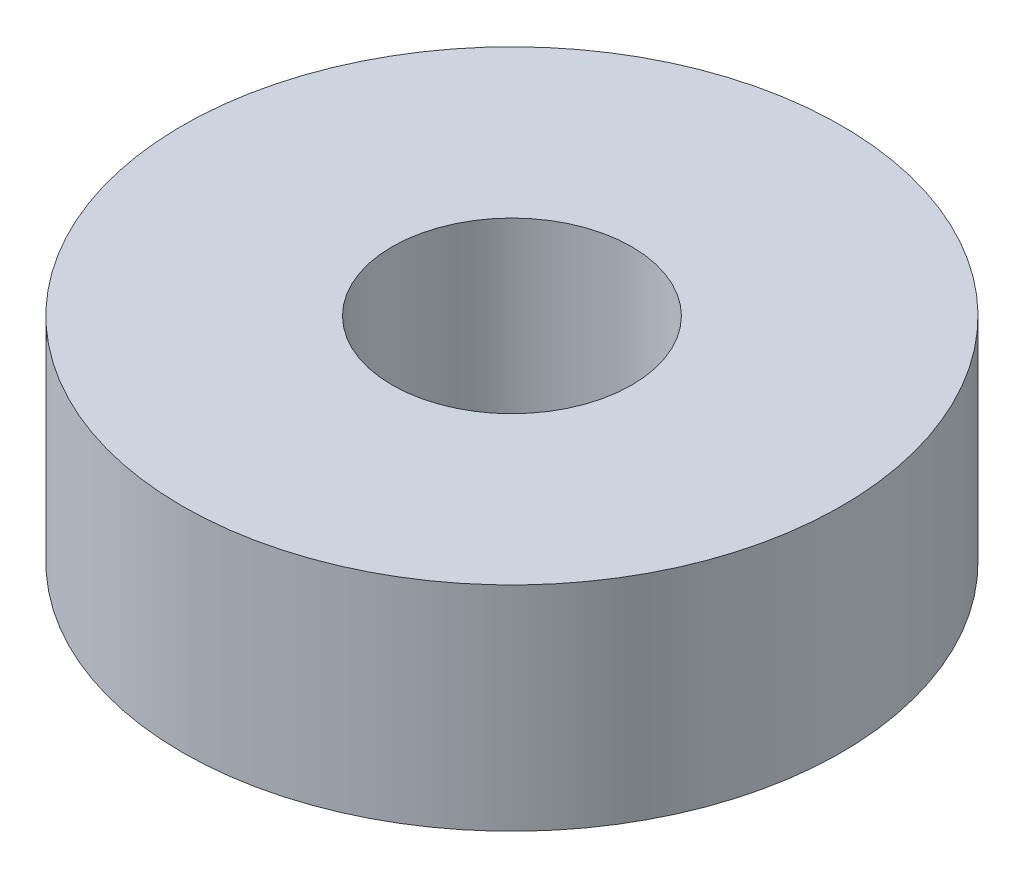
ISO-10303-21;
HEADER;
FILE_DESCRIPTION(('STEP AP214'),'2;1');
FILE_NAME('part.step','',(''),(''),'','','');
FILE_SCHEMA(('AUTOMOTIVE_DESIGN { 1 0 10303 214 1 1 1 1 }'));
ENDSEC;
DATA;
#1=APPLICATION_CONTEXT('core data for automotive mechanical design processes');
#2=APPLICATION_PROTOCOL_DEFINITION('international standard','automotive_design',2000,#1);
#3=PRODUCT_CONTEXT('',#1,'mechanical');
#4=PRODUCT('Part','Part','',(#3));
#5=PRODUCT_RELATED_PRODUCT_CATEGORY('part','',(#4));
#6=PRODUCT_DEFINITION_FORMATION('','',#4);
#7=PRODUCT_DEFINITION_CONTEXT('part definition',#1,'design');
#8=PRODUCT_DEFINITION('design','',#6,#7);
#9=PRODUCT_DEFINITION_SHAPE('','',#8);
#10=(LENGTH_UNIT() NAMED_UNIT(*) SI_UNIT(.MILLI.,.METRE.));
#11=(NAMED_UNIT(*) PLANE_ANGLE_UNIT() SI_UNIT($,.RADIAN.));
#12=(NAMED_UNIT(*) SI_UNIT($,.STERADIAN.) SOLID_ANGLE_UNIT());
#13=UNCERTAINTY_MEASURE_WITH_UNIT(LENGTH_MEASURE(1.E-05),#10,'distance_accuracy_value','');
#14=(GEOMETRIC_REPRESENTATION_CONTEXT(3) GLOBAL_UNCERTAINTY_ASSIGNED_CONTEXT((#13)) GLOBAL_UNIT_ASSIGNED_CONTEXT((#10,
#11,#12)) REPRESENTATION_CONTEXT('',''));
#15=CARTESIAN_POINT('',(0.,0.,0.));
#16=DIRECTION('',(0.,0.,1.));
#17=DIRECTION('',(1.,0.,0.));
#18=AXIS2_PLACEMENT_3D('',#15,#16,#17);
#19=CARTESIAN_POINT('',(0.,7.12,0.));
#20=DIRECTION('',(0.,1.,0.));
#21=DIRECTION('',(0.,0.,1.));
#22=AXIS2_PLACEMENT_3D('',#19,#20,#21);
#23=PLANE('',#22);
#24=CARTESIAN_POINT('',(0.,7.12,0.));
#25=DIRECTION('',(0.,1.,0.));
#26=DIRECTION('',(0.,0.,1.));
#27=AXIS2_PLACEMENT_3D('',#24,#25,#26);
#28=CIRCLE('',#27,11.);
#29=CARTESIAN_POINT('',(0.,7.12,11.));
#30=VERTEX_POINT('',#29);
#31=EDGE_CURVE('E10',#30,#30,#28,.T.);
#32=ORIENTED_EDGE('',*,*,#31,.T.);
#33=EDGE_LOOP('',(#32));
#34=FACE_BOUND('',#33,.T.);
#35=CARTESIAN_POINT('',(0.,7.12,0.));
#36=DIRECTION('',(0.,1.,0.));
#37=DIRECTION('',(0.,0.,1.));
#38=AXIS2_PLACEMENT_3D('',#35,#36,#37);
#39=CIRCLE('',#38,4.);
#40=CARTESIAN_POINT('',(0.,7.12,4.));
#41=VERTEX_POINT('',#40);
#42=EDGE_CURVE('E42',#41,#41,#39,.T.);
#43=ORIENTED_EDGE('',*,*,#42,.F.);
#44=EDGE_LOOP('',(#43));
#45=FACE_BOUND('',#44,.T.);
#46=ADVANCED_FACE('F31',(#34,#45),#23,.T.);
#47=CARTESIAN_POINT('',(0.,0.,0.));
#48=DIRECTION('',(0.,1.,0.));
#49=DIRECTION('',(0.,0.,1.));
#50=AXIS2_PLACEMENT_3D('',#47,#48,#49);
#51=PLANE('',#50);
#52=CARTESIAN_POINT('',(0.,0.,0.));
#53=DIRECTION('',(0.,1.,0.));
#54=DIRECTION('',(0.,0.,1.));
#55=AXIS2_PLACEMENT_3D('',#52,#53,#54);
#56=CIRCLE('',#55,11.);
#57=CARTESIAN_POINT('',(0.,0.,11.));
#58=VERTEX_POINT('',#57);
#59=EDGE_CURVE('E35',#58,#58,#56,.T.);
#60=ORIENTED_EDGE('',*,*,#59,.F.);
#61=EDGE_LOOP('',(#60));
#62=FACE_BOUND('',#61,.T.);
#63=CARTESIAN_POINT('',(0.,0.,0.));
#64=DIRECTION('',(0.,1.,0.));
#65=DIRECTION('',(0.,0.,1.));
#66=AXIS2_PLACEMENT_3D('',#63,#64,#65);
#67=CIRCLE('',#66,4.);
#68=CARTESIAN_POINT('',(0.,0.,4.));
#69=VERTEX_POINT('',#68);
#70=EDGE_CURVE('E44',#69,#69,#67,.T.);
#71=ORIENTED_EDGE('',*,*,#70,.T.);
#72=EDGE_LOOP('',(#71));
#73=FACE_BOUND('',#72,.T.);
#74=ADVANCED_FACE('F54',(#62,#73),#51,.F.);
#75=CARTESIAN_POINT('',(0.,7.12,0.));
#76=DIRECTION('',(0.,-1.,0.));
#77=DIRECTION('',(0.,0.,-1.));
#78=AXIS2_PLACEMENT_3D('',#75,#76,#77);
#79=CYLINDRICAL_SURFACE('',#78,11.);
#80=ORIENTED_EDGE('',*,*,#31,.F.);
#81=EDGE_LOOP('',(#80));
#82=FACE_BOUND('',#81,.T.);
#83=ORIENTED_EDGE('',*,*,#59,.T.);
#84=EDGE_LOOP('',(#83));
#85=FACE_BOUND('',#84,.T.);
#86=ADVANCED_FACE('F33',(#82,#85),#79,.T.);
#87=CARTESIAN_POINT('',(0.,7.12,0.));
#88=DIRECTION('',(0.,-1.,0.));
#89=DIRECTION('',(0.,0.,-1.));
#90=AXIS2_PLACEMENT_3D('',#87,#88,#89);
#91=CYLINDRICAL_SURFACE('',#90,4.);
#92=ORIENTED_EDGE('',*,*,#42,.T.);
#93=EDGE_LOOP('',(#92));
#94=FACE_BOUND('',#93,.T.);
#95=ORIENTED_EDGE('',*,*,#70,.F.);
#96=EDGE_LOOP('',(#95));
#97=FACE_BOUND('',#96,.T.);
#98=ADVANCED_FACE('F50',(#94,#97),#91,.F.);
#99=CLOSED_SHELL('',(#46,#74,#86,#98));
#100=MANIFOLD_SOLID_BREP('B2',#99);
#101=ADVANCED_BREP_SHAPE_REPRESENTATION('',(#18,#100),#14);
#102=SHAPE_DEFINITION_REPRESENTATION(#9,#101);
ENDSEC;
END-ISO-10303-21;
